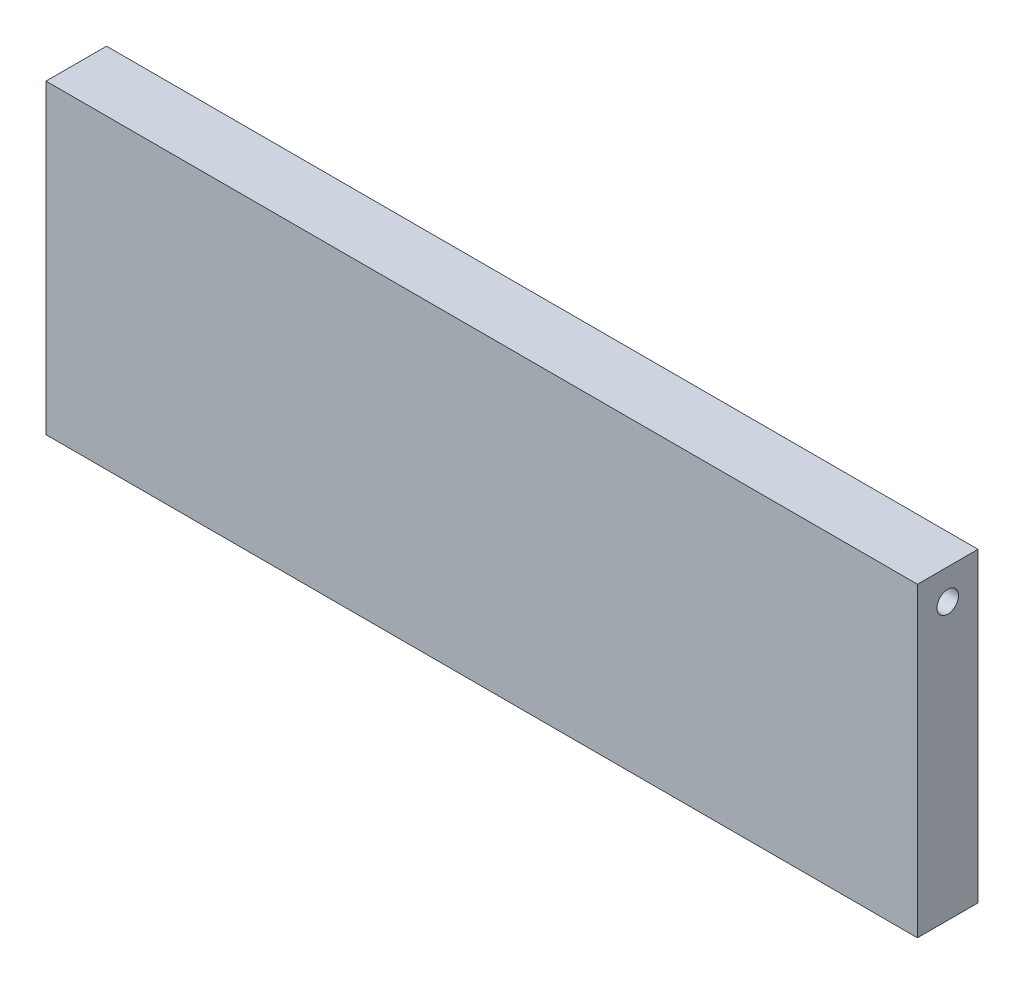
ISO-10303-21;
HEADER;
FILE_DESCRIPTION(('STEP AP214'),'2;1');
FILE_NAME('part.step','',(''),(''),'','','');
FILE_SCHEMA(('AUTOMOTIVE_DESIGN { 1 0 10303 214 1 1 1 1 }'));
ENDSEC;
DATA;
#1=APPLICATION_CONTEXT('core data for automotive mechanical design processes');
#2=APPLICATION_PROTOCOL_DEFINITION('international standard','automotive_design',2000,#1);
#3=PRODUCT_CONTEXT('',#1,'mechanical');
#4=PRODUCT('Part','Part','',(#3));
#5=PRODUCT_RELATED_PRODUCT_CATEGORY('part','',(#4));
#6=PRODUCT_DEFINITION_FORMATION('','',#4);
#7=PRODUCT_DEFINITION_CONTEXT('part definition',#1,'design');
#8=PRODUCT_DEFINITION('design','',#6,#7);
#9=PRODUCT_DEFINITION_SHAPE('','',#8);
#10=(LENGTH_UNIT() NAMED_UNIT(*) SI_UNIT(.MILLI.,.METRE.));
#11=(NAMED_UNIT(*) PLANE_ANGLE_UNIT() SI_UNIT($,.RADIAN.));
#12=(NAMED_UNIT(*) SI_UNIT($,.STERADIAN.) SOLID_ANGLE_UNIT());
#13=UNCERTAINTY_MEASURE_WITH_UNIT(LENGTH_MEASURE(1.E-05),#10,'distance_accuracy_value','');
#14=(GEOMETRIC_REPRESENTATION_CONTEXT(3) GLOBAL_UNCERTAINTY_ASSIGNED_CONTEXT((#13)) GLOBAL_UNIT_ASSIGNED_CONTEXT((#10,
#11,#12)) REPRESENTATION_CONTEXT('',''));
#15=CARTESIAN_POINT('',(0.,0.,0.));
#16=DIRECTION('',(0.,0.,1.));
#17=DIRECTION('',(1.,0.,0.));
#18=AXIS2_PLACEMENT_3D('',#15,#16,#17);
#19=CARTESIAN_POINT('',(-91.44,32.131,6.35));
#20=DIRECTION('',(1.,0.,0.));
#21=DIRECTION('',(0.,0.,-1.));
#22=AXIS2_PLACEMENT_3D('',#19,#20,#21);
#23=PLANE('',#22);
#24=DIRECTION('',(0.,0.,1.));
#25=VECTOR('',#24,1.);
#26=CARTESIAN_POINT('',(-91.44,0.,6.35));
#27=LINE('',#26,#25);
#28=CARTESIAN_POINT('',(-91.44,0.,0.));
#29=VERTEX_POINT('',#28);
#30=CARTESIAN_POINT('',(-91.44,0.,6.35));
#31=VERTEX_POINT('',#30);
#32=EDGE_CURVE('E67',#29,#31,#27,.T.);
#33=ORIENTED_EDGE('',*,*,#32,.T.);
#34=DIRECTION('',(0.,-1.,0.));
#35=VECTOR('',#34,1.);
#36=CARTESIAN_POINT('',(-91.44,32.131,6.35));
#37=LINE('',#36,#35);
#38=CARTESIAN_POINT('',(-91.44,32.131,6.35));
#39=VERTEX_POINT('',#38);
#40=EDGE_CURVE('E90',#39,#31,#37,.T.);
#41=ORIENTED_EDGE('',*,*,#40,.F.);
#42=DIRECTION('',(0.,0.,1.));
#43=VECTOR('',#42,1.);
#44=CARTESIAN_POINT('',(-91.44,32.131,6.35));
#45=LINE('',#44,#43);
#46=CARTESIAN_POINT('',(-91.44,32.131,0.));
#47=VERTEX_POINT('',#46);
#48=EDGE_CURVE('E83',#47,#39,#45,.T.);
#49=ORIENTED_EDGE('',*,*,#48,.F.);
#50=DIRECTION('',(0.,-1.,0.));
#51=VECTOR('',#50,1.);
#52=CARTESIAN_POINT('',(-91.44,32.131,0.));
#53=LINE('',#52,#51);
#54=EDGE_CURVE('E42',#47,#29,#53,.T.);
#55=ORIENTED_EDGE('',*,*,#54,.T.);
#56=EDGE_LOOP('',(#33,#41,#49,#55));
#57=FACE_BOUND('',#56,.T.);
#58=CARTESIAN_POINT('',(-91.44,28.956,3.175));
#59=DIRECTION('',(1.,0.,0.));
#60=DIRECTION('',(0.,0.,-1.));
#61=AXIS2_PLACEMENT_3D('',#58,#59,#60);
#62=CIRCLE('',#61,1.1303);
#63=CARTESIAN_POINT('',(-91.44,28.956,2.0447));
#64=VERTEX_POINT('',#63);
#65=EDGE_CURVE('E117',#64,#64,#62,.T.);
#66=ORIENTED_EDGE('',*,*,#65,.T.);
#67=EDGE_LOOP('',(#66));
#68=FACE_BOUND('',#67,.T.);
#69=ADVANCED_FACE('F33',(#57,#68),#23,.F.);
#70=CARTESIAN_POINT('',(0.,32.131,6.35));
#71=DIRECTION('',(-1.,0.,0.));
#72=DIRECTION('',(0.,0.,1.));
#73=AXIS2_PLACEMENT_3D('',#70,#71,#72);
#74=PLANE('',#73);
#75=CARTESIAN_POINT('',(0.,28.956,3.175));
#76=DIRECTION('',(1.,0.,0.));
#77=DIRECTION('',(0.,0.,-1.));
#78=AXIS2_PLACEMENT_3D('',#75,#76,#77);
#79=CIRCLE('',#78,1.1303);
#80=CARTESIAN_POINT('',(0.,28.956,2.0447));
#81=VERTEX_POINT('',#80);
#82=EDGE_CURVE('E111',#81,#81,#79,.T.);
#83=ORIENTED_EDGE('',*,*,#82,.F.);
#84=EDGE_LOOP('',(#83));
#85=FACE_BOUND('',#84,.T.);
#86=DIRECTION('',(0.,0.,-1.));
#87=VECTOR('',#86,1.);
#88=CARTESIAN_POINT('',(0.,0.,6.35));
#89=LINE('',#88,#87);
#90=CARTESIAN_POINT('',(0.,0.,6.35));
#91=VERTEX_POINT('',#90);
#92=CARTESIAN_POINT('',(0.,0.,0.));
#93=VERTEX_POINT('',#92);
#94=EDGE_CURVE('E97',#91,#93,#89,.T.);
#95=ORIENTED_EDGE('',*,*,#94,.T.);
#96=DIRECTION('',(0.,-1.,0.));
#97=VECTOR('',#96,1.);
#98=CARTESIAN_POINT('',(0.,32.131,0.));
#99=LINE('',#98,#97);
#100=CARTESIAN_POINT('',(0.,32.131,0.));
#101=VERTEX_POINT('',#100);
#102=EDGE_CURVE('E11',#101,#93,#99,.T.);
#103=ORIENTED_EDGE('',*,*,#102,.F.);
#104=DIRECTION('',(0.,0.,-1.));
#105=VECTOR('',#104,1.);
#106=CARTESIAN_POINT('',(0.,32.131,6.35));
#107=LINE('',#106,#105);
#108=CARTESIAN_POINT('',(0.,32.131,6.35));
#109=VERTEX_POINT('',#108);
#110=EDGE_CURVE('E85',#109,#101,#107,.T.);
#111=ORIENTED_EDGE('',*,*,#110,.F.);
#112=DIRECTION('',(0.,-1.,0.));
#113=VECTOR('',#112,1.);
#114=CARTESIAN_POINT('',(0.,32.131,6.35));
#115=LINE('',#114,#113);
#116=EDGE_CURVE('E93',#109,#91,#115,.T.);
#117=ORIENTED_EDGE('',*,*,#116,.T.);
#118=EDGE_LOOP('',(#95,#103,#111,#117));
#119=FACE_BOUND('',#118,.T.);
#120=ADVANCED_FACE('F35',(#85,#119),#74,.F.);
#121=CARTESIAN_POINT('',(-91.44,32.131,0.));
#122=DIRECTION('',(0.,0.,1.));
#123=DIRECTION('',(1.,0.,0.));
#124=AXIS2_PLACEMENT_3D('',#121,#122,#123);
#125=PLANE('',#124);
#126=DIRECTION('',(-1.,0.,0.));
#127=VECTOR('',#126,1.);
#128=CARTESIAN_POINT('',(-91.44,0.,0.));
#129=LINE('',#128,#127);
#130=EDGE_CURVE('E89',#93,#29,#129,.T.);
#131=ORIENTED_EDGE('',*,*,#130,.T.);
#132=ORIENTED_EDGE('',*,*,#54,.F.);
#133=DIRECTION('',(-1.,0.,0.));
#134=VECTOR('',#133,1.);
#135=CARTESIAN_POINT('',(-91.44,32.131,0.));
#136=LINE('',#135,#134);
#137=EDGE_CURVE('E80',#101,#47,#136,.T.);
#138=ORIENTED_EDGE('',*,*,#137,.F.);
#139=ORIENTED_EDGE('',*,*,#102,.T.);
#140=EDGE_LOOP('',(#131,#132,#138,#139));
#141=FACE_BOUND('',#140,.T.);
#142=ADVANCED_FACE('F88',(#141),#125,.F.);
#143=CARTESIAN_POINT('',(-91.44,32.131,6.35));
#144=DIRECTION('',(0.,0.,-1.));
#145=DIRECTION('',(-1.,0.,0.));
#146=AXIS2_PLACEMENT_3D('',#143,#144,#145);
#147=PLANE('',#146);
#148=DIRECTION('',(1.,0.,0.));
#149=VECTOR('',#148,1.);
#150=CARTESIAN_POINT('',(-91.44,0.,6.35));
#151=LINE('',#150,#149);
#152=EDGE_CURVE('E73',#31,#91,#151,.T.);
#153=ORIENTED_EDGE('',*,*,#152,.T.);
#154=ORIENTED_EDGE('',*,*,#116,.F.);
#155=DIRECTION('',(1.,0.,0.));
#156=VECTOR('',#155,1.);
#157=CARTESIAN_POINT('',(-91.44,32.131,6.35));
#158=LINE('',#157,#156);
#159=EDGE_CURVE('E50',#39,#109,#158,.T.);
#160=ORIENTED_EDGE('',*,*,#159,.F.);
#161=ORIENTED_EDGE('',*,*,#40,.T.);
#162=EDGE_LOOP('',(#153,#154,#160,#161));
#163=FACE_BOUND('',#162,.T.);
#164=ADVANCED_FACE('F105',(#163),#147,.F.);
#165=CARTESIAN_POINT('',(0.,32.131,0.));
#166=DIRECTION('',(0.,-1.,0.));
#167=DIRECTION('',(0.,0.,-1.));
#168=AXIS2_PLACEMENT_3D('',#165,#166,#167);
#169=PLANE('',#168);
#170=ORIENTED_EDGE('',*,*,#110,.T.);
#171=ORIENTED_EDGE('',*,*,#137,.T.);
#172=ORIENTED_EDGE('',*,*,#48,.T.);
#173=ORIENTED_EDGE('',*,*,#159,.T.);
#174=EDGE_LOOP('',(#170,#171,#172,#173));
#175=FACE_BOUND('',#174,.T.);
#176=ADVANCED_FACE('F81',(#175),#169,.F.);
#177=CARTESIAN_POINT('',(0.,0.,0.));
#178=DIRECTION('',(0.,-1.,0.));
#179=DIRECTION('',(0.,0.,-1.));
#180=AXIS2_PLACEMENT_3D('',#177,#178,#179);
#181=PLANE('',#180);
#182=ORIENTED_EDGE('',*,*,#94,.F.);
#183=ORIENTED_EDGE('',*,*,#152,.F.);
#184=ORIENTED_EDGE('',*,*,#32,.F.);
#185=ORIENTED_EDGE('',*,*,#130,.F.);
#186=EDGE_LOOP('',(#182,#183,#184,#185));
#187=FACE_BOUND('',#186,.T.);
#188=ADVANCED_FACE('F108',(#187),#181,.T.);
#189=CARTESIAN_POINT('',(-12.7,28.956,3.175));
#190=DIRECTION('',(1.,0.,0.));
#191=DIRECTION('',(0.,0.,-1.));
#192=AXIS2_PLACEMENT_3D('',#189,#190,#191);
#193=CYLINDRICAL_SURFACE('',#192,1.1303);
#194=CARTESIAN_POINT('',(-12.7,28.956,3.175));
#195=DIRECTION('',(1.,0.,0.));
#196=DIRECTION('',(0.,0.,-1.));
#197=AXIS2_PLACEMENT_3D('',#194,#195,#196);
#198=CIRCLE('',#197,1.1303);
#199=CARTESIAN_POINT('',(-12.7,28.956,2.0447));
#200=VERTEX_POINT('',#199);
#201=EDGE_CURVE('E100',#200,#200,#198,.T.);
#202=ORIENTED_EDGE('',*,*,#201,.F.);
#203=EDGE_LOOP('',(#202));
#204=FACE_BOUND('',#203,.T.);
#205=ORIENTED_EDGE('',*,*,#82,.T.);
#206=EDGE_LOOP('',(#205));
#207=FACE_BOUND('',#206,.T.);
#208=ADVANCED_FACE('F156',(#204,#207),#193,.F.);
#209=CARTESIAN_POINT('',(-12.7,28.956,3.175));
#210=DIRECTION('',(1.,0.,0.));
#211=DIRECTION('',(0.,0.,-1.));
#212=AXIS2_PLACEMENT_3D('',#209,#210,#211);
#213=PLANE('',#212);
#214=ORIENTED_EDGE('',*,*,#201,.T.);
#215=EDGE_LOOP('',(#214));
#216=FACE_BOUND('',#215,.T.);
#217=ADVANCED_FACE('F132',(#216),#213,.T.);
#218=CARTESIAN_POINT('',(-78.74,28.956,3.175));
#219=DIRECTION('',(-1.,0.,0.));
#220=DIRECTION('',(0.,0.,1.));
#221=AXIS2_PLACEMENT_3D('',#218,#219,#220);
#222=CYLINDRICAL_SURFACE('',#221,1.1303);
#223=CARTESIAN_POINT('',(-78.74,28.956,3.175));
#224=DIRECTION('',(1.,0.,0.));
#225=DIRECTION('',(0.,0.,-1.));
#226=AXIS2_PLACEMENT_3D('',#223,#224,#225);
#227=CIRCLE('',#226,1.1303);
#228=CARTESIAN_POINT('',(-78.74,28.956,2.0447));
#229=VERTEX_POINT('',#228);
#230=EDGE_CURVE('E114',#229,#229,#227,.T.);
#231=ORIENTED_EDGE('',*,*,#230,.T.);
#232=EDGE_LOOP('',(#231));
#233=FACE_BOUND('',#232,.T.);
#234=ORIENTED_EDGE('',*,*,#65,.F.);
#235=EDGE_LOOP('',(#234));
#236=FACE_BOUND('',#235,.T.);
#237=ADVANCED_FACE('F123',(#233,#236),#222,.F.);
#238=CARTESIAN_POINT('',(-78.74,28.956,3.175));
#239=DIRECTION('',(-1.,0.,0.));
#240=DIRECTION('',(0.,0.,-1.));
#241=AXIS2_PLACEMENT_3D('',#238,#239,#240);
#242=PLANE('',#241);
#243=ORIENTED_EDGE('',*,*,#230,.F.);
#244=EDGE_LOOP('',(#243));
#245=FACE_BOUND('',#244,.T.);
#246=ADVANCED_FACE('F126',(#245),#242,.T.);
#247=CLOSED_SHELL('',(#69,#120,#142,#164,#176,#188,#208,#217,#237,#246));
#248=MANIFOLD_SOLID_BREP('B2',#247);
#249=ADVANCED_BREP_SHAPE_REPRESENTATION('',(#18,#248),#14);
#250=SHAPE_DEFINITION_REPRESENTATION(#9,#249);
ENDSEC;
END-ISO-10303-21;
